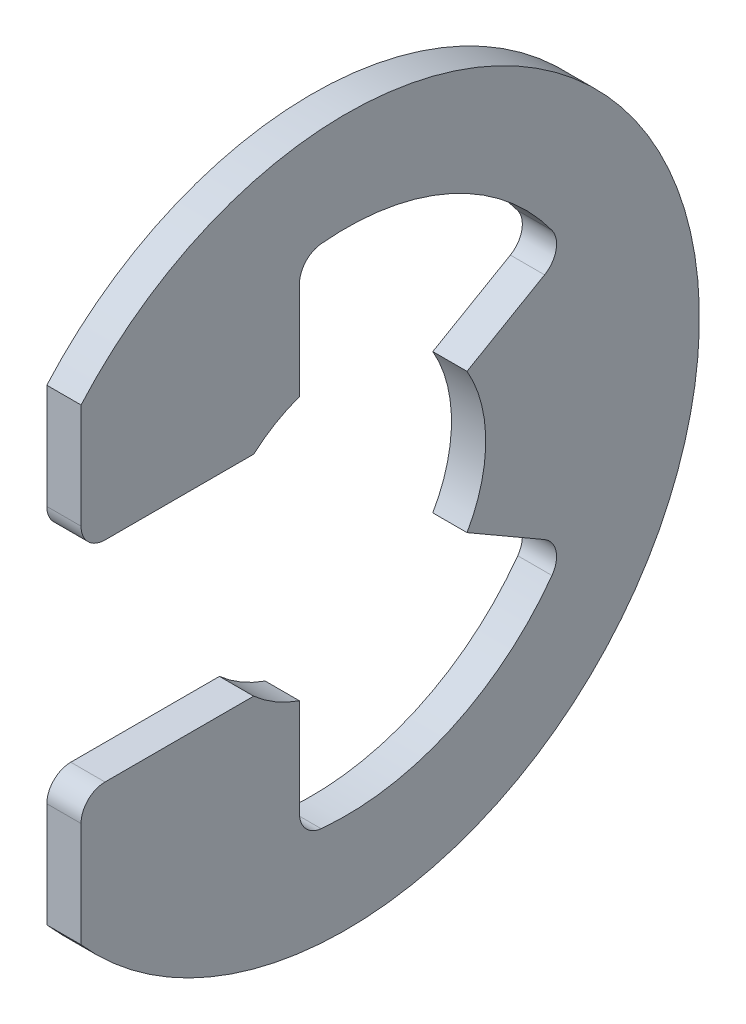
ISO-10303-21;
HEADER;
FILE_DESCRIPTION(('STEP AP214'),'2;1');
FILE_NAME('part.step','',(''),(''),'','','');
FILE_SCHEMA(('AUTOMOTIVE_DESIGN { 1 0 10303 214 1 1 1 1 }'));
ENDSEC;
DATA;
#1=APPLICATION_CONTEXT('core data for automotive mechanical design processes');
#2=APPLICATION_PROTOCOL_DEFINITION('international standard','automotive_design',2000,#1);
#3=PRODUCT_CONTEXT('',#1,'mechanical');
#4=PRODUCT('Part','Part','',(#3));
#5=PRODUCT_RELATED_PRODUCT_CATEGORY('part','',(#4));
#6=PRODUCT_DEFINITION_FORMATION('','',#4);
#7=PRODUCT_DEFINITION_CONTEXT('part definition',#1,'design');
#8=PRODUCT_DEFINITION('design','',#6,#7);
#9=PRODUCT_DEFINITION_SHAPE('','',#8);
#10=(LENGTH_UNIT() NAMED_UNIT(*) SI_UNIT(.MILLI.,.METRE.));
#11=(NAMED_UNIT(*) PLANE_ANGLE_UNIT() SI_UNIT($,.RADIAN.));
#12=(NAMED_UNIT(*) SI_UNIT($,.STERADIAN.) SOLID_ANGLE_UNIT());
#13=UNCERTAINTY_MEASURE_WITH_UNIT(LENGTH_MEASURE(1.E-05),#10,'distance_accuracy_value','');
#14=(GEOMETRIC_REPRESENTATION_CONTEXT(3) GLOBAL_UNCERTAINTY_ASSIGNED_CONTEXT((#13)) GLOBAL_UNIT_ASSIGNED_CONTEXT((#10,
#11,#12)) REPRESENTATION_CONTEXT('',''));
#15=CARTESIAN_POINT('',(0.,0.,0.));
#16=DIRECTION('',(0.,0.,1.));
#17=DIRECTION('',(1.,0.,0.));
#18=AXIS2_PLACEMENT_3D('',#15,#16,#17);
#19=CARTESIAN_POINT('',(0.3175,0.,0.));
#20=DIRECTION('',(-1.,0.,0.));
#21=DIRECTION('',(0.,0.,1.));
#22=AXIS2_PLACEMENT_3D('',#19,#20,#21);
#23=CYLINDRICAL_SURFACE('',#22,6.5532);
#24=CARTESIAN_POINT('',(-0.3175,0.,0.));
#25=DIRECTION('',(1.,0.,0.));
#26=DIRECTION('',(0.,0.,-1.));
#27=AXIS2_PLACEMENT_3D('',#24,#25,#26);
#28=CIRCLE('',#27,6.5532);
#29=CARTESIAN_POINT('',(-0.3175,-4.33453437291712,4.9149));
#30=VERTEX_POINT('',#29);
#31=CARTESIAN_POINT('',(-0.3175,4.33453437291712,4.9149));
#32=VERTEX_POINT('',#31);
#33=EDGE_CURVE('E194',#30,#32,#28,.T.);
#34=ORIENTED_EDGE('',*,*,#33,.T.);
#35=DIRECTION('',(-1.,0.,0.));
#36=VECTOR('',#35,1.);
#37=CARTESIAN_POINT('',(0.3175,4.33453437291712,4.9149));
#38=LINE('',#37,#36);
#39=CARTESIAN_POINT('',(0.3175,4.33453437291712,4.9149));
#40=VERTEX_POINT('',#39);
#41=EDGE_CURVE('E175',#40,#32,#38,.T.);
#42=ORIENTED_EDGE('',*,*,#41,.F.);
#43=CARTESIAN_POINT('',(0.3175,0.,0.));
#44=DIRECTION('',(1.,0.,0.));
#45=DIRECTION('',(0.,0.,-1.));
#46=AXIS2_PLACEMENT_3D('',#43,#44,#45);
#47=CIRCLE('',#46,6.5532);
#48=CARTESIAN_POINT('',(0.3175,-4.33453437291712,4.9149));
#49=VERTEX_POINT('',#48);
#50=EDGE_CURVE('E181',#49,#40,#47,.T.);
#51=ORIENTED_EDGE('',*,*,#50,.F.);
#52=DIRECTION('',(-1.,0.,0.));
#53=VECTOR('',#52,1.);
#54=CARTESIAN_POINT('',(0.3175,-4.33453437291712,4.9149));
#55=LINE('',#54,#53);
#56=EDGE_CURVE('E296',#49,#30,#55,.T.);
#57=ORIENTED_EDGE('',*,*,#56,.T.);
#58=EDGE_LOOP('',(#34,#42,#51,#57));
#59=FACE_BOUND('',#58,.T.);
#60=ADVANCED_FACE('F32',(#59),#23,.T.);
#61=CARTESIAN_POINT('',(0.3175,4.33453437291712,4.9149));
#62=DIRECTION('',(0.,0.,-1.));
#63=DIRECTION('',(-1.,0.,0.));
#64=AXIS2_PLACEMENT_3D('',#61,#62,#63);
#65=PLANE('',#64);
#66=DIRECTION('',(0.,-1.,0.));
#67=VECTOR('',#66,1.);
#68=CARTESIAN_POINT('',(-0.3175,4.33453437291712,4.9149));
#69=LINE('',#68,#67);
#70=CARTESIAN_POINT('',(-0.3175,2.3876,4.9149));
#71=VERTEX_POINT('',#70);
#72=EDGE_CURVE('E298',#32,#71,#69,.T.);
#73=ORIENTED_EDGE('',*,*,#72,.T.);
#74=DIRECTION('',(-1.,0.,0.));
#75=VECTOR('',#74,1.);
#76=CARTESIAN_POINT('',(0.3175,2.3876,4.9149));
#77=LINE('',#76,#75);
#78=CARTESIAN_POINT('',(0.3175,2.3876,4.9149));
#79=VERTEX_POINT('',#78);
#80=EDGE_CURVE('E178',#71,#79,#77,.F.);
#81=ORIENTED_EDGE('',*,*,#80,.T.);
#82=DIRECTION('',(0.,-1.,0.));
#83=VECTOR('',#82,1.);
#84=CARTESIAN_POINT('',(0.3175,4.33453437291712,4.9149));
#85=LINE('',#84,#83);
#86=EDGE_CURVE('E170',#40,#79,#85,.T.);
#87=ORIENTED_EDGE('',*,*,#86,.F.);
#88=ORIENTED_EDGE('',*,*,#41,.T.);
#89=EDGE_LOOP('',(#73,#81,#87,#88));
#90=FACE_BOUND('',#89,.T.);
#91=ADVANCED_FACE('F173',(#90),#65,.F.);
#92=CARTESIAN_POINT('',(0.3175,1.9431,1.71365312417654));
#93=DIRECTION('',(0.,1.,0.));
#94=DIRECTION('',(0.,0.,1.));
#95=AXIS2_PLACEMENT_3D('',#92,#93,#94);
#96=PLANE('',#95);
#97=DIRECTION('',(0.,0.,-1.));
#98=VECTOR('',#97,1.);
#99=CARTESIAN_POINT('',(0.3175,1.9431,1.71365312417654));
#100=LINE('',#99,#98);
#101=CARTESIAN_POINT('',(0.3175,1.9431,4.4704));
#102=VERTEX_POINT('',#101);
#103=CARTESIAN_POINT('',(0.3175,1.9431,1.71365312417654));
#104=VERTEX_POINT('',#103);
#105=EDGE_CURVE('E180',#102,#104,#100,.T.);
#106=ORIENTED_EDGE('',*,*,#105,.F.);
#107=DIRECTION('',(-1.,0.,0.));
#108=VECTOR('',#107,1.);
#109=CARTESIAN_POINT('',(0.3175,1.9431,4.4704));
#110=LINE('',#109,#108);
#111=CARTESIAN_POINT('',(-0.3175,1.9431,4.4704));
#112=VERTEX_POINT('',#111);
#113=EDGE_CURVE('E222',#102,#112,#110,.T.);
#114=ORIENTED_EDGE('',*,*,#113,.T.);
#115=DIRECTION('',(0.,0.,-1.));
#116=VECTOR('',#115,1.);
#117=CARTESIAN_POINT('',(-0.3175,1.9431,1.71365312417654));
#118=LINE('',#117,#116);
#119=CARTESIAN_POINT('',(-0.3175,1.9431,1.71365312417654));
#120=VERTEX_POINT('',#119);
#121=EDGE_CURVE('E300',#112,#120,#118,.T.);
#122=ORIENTED_EDGE('',*,*,#121,.T.);
#123=DIRECTION('',(-1.,0.,0.));
#124=VECTOR('',#123,1.);
#125=CARTESIAN_POINT('',(0.3175,1.9431,1.71365312417654));
#126=LINE('',#125,#124);
#127=EDGE_CURVE('E196',#104,#120,#126,.T.);
#128=ORIENTED_EDGE('',*,*,#127,.F.);
#129=EDGE_LOOP('',(#106,#114,#122,#128));
#130=FACE_BOUND('',#129,.T.);
#131=ADVANCED_FACE('F354',(#130),#96,.F.);
#132=CARTESIAN_POINT('',(0.3175,0.,0.));
#133=DIRECTION('',(-1.,0.,0.));
#134=DIRECTION('',(0.,0.,1.));
#135=AXIS2_PLACEMENT_3D('',#132,#133,#134);
#136=CYLINDRICAL_SURFACE('',#135,2.5908);
#137=CARTESIAN_POINT('',(-0.3175,0.,0.));
#138=DIRECTION('',(-1.,0.,0.));
#139=DIRECTION('',(0.,0.,1.));
#140=AXIS2_PLACEMENT_3D('',#137,#138,#139);
#141=CIRCLE('',#140,2.5908);
#142=CARTESIAN_POINT('',(-0.3175,2.44262966493081,0.863599999999999));
#143=VERTEX_POINT('',#142);
#144=EDGE_CURVE('E302',#120,#143,#141,.T.);
#145=ORIENTED_EDGE('',*,*,#144,.T.);
#146=DIRECTION('',(-1.,0.,0.));
#147=VECTOR('',#146,1.);
#148=CARTESIAN_POINT('',(0.3175,2.44262966493081,0.863599999999999));
#149=LINE('',#148,#147);
#150=CARTESIAN_POINT('',(0.3175,2.44262966493081,0.863599999999999));
#151=VERTEX_POINT('',#150);
#152=EDGE_CURVE('E202',#151,#143,#149,.T.);
#153=ORIENTED_EDGE('',*,*,#152,.F.);
#154=CARTESIAN_POINT('',(0.3175,0.,0.));
#155=DIRECTION('',(-1.,0.,0.));
#156=DIRECTION('',(0.,0.,1.));
#157=AXIS2_PLACEMENT_3D('',#154,#155,#156);
#158=CIRCLE('',#157,2.5908);
#159=EDGE_CURVE('E347',#104,#151,#158,.T.);
#160=ORIENTED_EDGE('',*,*,#159,.F.);
#161=ORIENTED_EDGE('',*,*,#127,.T.);
#162=EDGE_LOOP('',(#145,#153,#160,#161));
#163=FACE_BOUND('',#162,.T.);
#164=ADVANCED_FACE('F355',(#163),#136,.F.);
#165=CARTESIAN_POINT('',(0.3175,4.63979773786796,0.863599999999999));
#166=DIRECTION('',(0.,0.,1.));
#167=DIRECTION('',(0.,-1.,0.));
#168=AXIS2_PLACEMENT_3D('',#165,#166,#167);
#169=PLANE('',#168);
#170=DIRECTION('',(0.,1.,0.));
#171=VECTOR('',#170,1.);
#172=CARTESIAN_POINT('',(-0.3175,4.63979773786796,0.863599999999999));
#173=LINE('',#172,#171);
#174=CARTESIAN_POINT('',(-0.3175,4.25439094196036,0.863599999999999));
#175=VERTEX_POINT('',#174);
#176=EDGE_CURVE('E265',#143,#175,#173,.T.);
#177=ORIENTED_EDGE('',*,*,#176,.T.);
#178=DIRECTION('',(1.,0.,0.));
#179=VECTOR('',#178,1.);
#180=CARTESIAN_POINT('',(0.3175,4.25439094196036,0.863599999999999));
#181=LINE('',#180,#179);
#182=CARTESIAN_POINT('',(0.3175,4.25439094196036,0.863599999999999));
#183=VERTEX_POINT('',#182);
#184=EDGE_CURVE('E231',#175,#183,#181,.T.);
#185=ORIENTED_EDGE('',*,*,#184,.T.);
#186=DIRECTION('',(0.,1.,0.));
#187=VECTOR('',#186,1.);
#188=CARTESIAN_POINT('',(0.3175,4.63979773786796,0.863599999999999));
#189=LINE('',#188,#187);
#190=EDGE_CURVE('E281',#151,#183,#189,.T.);
#191=ORIENTED_EDGE('',*,*,#190,.F.);
#192=ORIENTED_EDGE('',*,*,#152,.T.);
#193=EDGE_LOOP('',(#177,#185,#191,#192));
#194=FACE_BOUND('',#193,.T.);
#195=ADVANCED_FACE('F337',(#194),#169,.F.);
#196=CARTESIAN_POINT('',(0.3175,0.,0.));
#197=DIRECTION('',(-1.,0.,0.));
#198=DIRECTION('',(0.,0.,1.));
#199=AXIS2_PLACEMENT_3D('',#196,#197,#198);
#200=CYLINDRICAL_SURFACE('',#199,4.71948387096774);
#201=CARTESIAN_POINT('',(0.3175,0.,0.));
#202=DIRECTION('',(-1.,0.,0.));
#203=DIRECTION('',(0.,0.,-1.));
#204=AXIS2_PLACEMENT_3D('',#201,#202,#203);
#205=CIRCLE('',#204,4.71948387096774);
#206=CARTESIAN_POINT('',(0.3175,4.69674975097109,0.462676760900813));
#207=VERTEX_POINT('',#206);
#208=CARTESIAN_POINT('',(0.3175,2.77192549140521,-3.81968023248316));
#209=VERTEX_POINT('',#208);
#210=EDGE_CURVE('E271',#207,#209,#205,.T.);
#211=ORIENTED_EDGE('',*,*,#210,.F.);
#212=DIRECTION('',(-1.,0.,0.));
#213=VECTOR('',#212,1.);
#214=CARTESIAN_POINT('',(0.3175,4.69674975097109,0.462676760900814));
#215=LINE('',#214,#213);
#216=CARTESIAN_POINT('',(-0.3175,4.69674975097109,0.462676760900813));
#217=VERTEX_POINT('',#216);
#218=EDGE_CURVE('E228',#207,#217,#215,.T.);
#219=ORIENTED_EDGE('',*,*,#218,.T.);
#220=CARTESIAN_POINT('',(-0.3175,0.,0.));
#221=DIRECTION('',(-1.,0.,0.));
#222=DIRECTION('',(0.,0.,-1.));
#223=AXIS2_PLACEMENT_3D('',#220,#221,#222);
#224=CIRCLE('',#223,4.71948387096774);
#225=CARTESIAN_POINT('',(-0.3175,2.77192549140521,-3.81968023248316));
#226=VERTEX_POINT('',#225);
#227=EDGE_CURVE('E254',#217,#226,#224,.T.);
#228=ORIENTED_EDGE('',*,*,#227,.T.);
#229=DIRECTION('',(-1.,0.,0.));
#230=VECTOR('',#229,1.);
#231=CARTESIAN_POINT('',(0.3175,2.77192549140521,-3.81968023248317));
#232=LINE('',#231,#230);
#233=EDGE_CURVE('E226',#226,#209,#232,.F.);
#234=ORIENTED_EDGE('',*,*,#233,.T.);
#235=EDGE_LOOP('',(#211,#219,#228,#234));
#236=FACE_BOUND('',#235,.T.);
#237=ADVANCED_FACE('F262',(#236),#200,.F.);
#238=CARTESIAN_POINT('',(0.3175,1.2954,-2.24369861612472));
#239=DIRECTION('',(0.,-0.866025403784438,-0.500000000000001));
#240=DIRECTION('',(0.,0.500000000000001,-0.866025403784438));
#241=AXIS2_PLACEMENT_3D('',#238,#239,#240);
#242=PLANE('',#241);
#243=DIRECTION('',(0.,-0.500000000000001,0.866025403784438));
#244=VECTOR('',#243,1.);
#245=CARTESIAN_POINT('',(0.3175,1.2954,-2.24369861612472));
#246=LINE('',#245,#244);
#247=CARTESIAN_POINT('',(0.3175,2.12590609194259,-3.68217736336474));
#248=VERTEX_POINT('',#247);
#249=CARTESIAN_POINT('',(0.3175,1.2954,-2.24369861612472));
#250=VERTEX_POINT('',#249);
#251=EDGE_CURVE('E269',#248,#250,#246,.T.);
#252=ORIENTED_EDGE('',*,*,#251,.F.);
#253=DIRECTION('',(1.,0.,0.));
#254=VECTOR('',#253,1.);
#255=CARTESIAN_POINT('',(-0.3175,2.12590609194259,-3.68217736336474));
#256=LINE('',#255,#254);
#257=CARTESIAN_POINT('',(-0.3175,2.12590609194259,-3.68217736336474));
#258=VERTEX_POINT('',#257);
#259=EDGE_CURVE('E235',#248,#258,#256,.F.);
#260=ORIENTED_EDGE('',*,*,#259,.T.);
#261=DIRECTION('',(0.,-0.500000000000001,0.866025403784438));
#262=VECTOR('',#261,1.);
#263=CARTESIAN_POINT('',(-0.3175,1.2954,-2.24369861612472));
#264=LINE('',#263,#262);
#265=CARTESIAN_POINT('',(-0.3175,1.2954,-2.24369861612472));
#266=VERTEX_POINT('',#265);
#267=EDGE_CURVE('E256',#258,#266,#264,.T.);
#268=ORIENTED_EDGE('',*,*,#267,.T.);
#269=DIRECTION('',(-1.,0.,0.));
#270=VECTOR('',#269,1.);
#271=CARTESIAN_POINT('',(0.3175,1.2954,-2.24369861612472));
#272=LINE('',#271,#270);
#273=EDGE_CURVE('E275',#250,#266,#272,.T.);
#274=ORIENTED_EDGE('',*,*,#273,.F.);
#275=EDGE_LOOP('',(#252,#260,#268,#274));
#276=FACE_BOUND('',#275,.T.);
#277=ADVANCED_FACE('F273',(#276),#242,.F.);
#278=CARTESIAN_POINT('',(0.3175,0.,0.));
#279=DIRECTION('',(-1.,0.,0.));
#280=DIRECTION('',(0.,0.,1.));
#281=AXIS2_PLACEMENT_3D('',#278,#279,#280);
#282=CYLINDRICAL_SURFACE('',#281,2.5908);
#283=CARTESIAN_POINT('',(-0.3175,0.,0.));
#284=DIRECTION('',(-1.,0.,0.));
#285=DIRECTION('',(0.,0.,1.));
#286=AXIS2_PLACEMENT_3D('',#283,#284,#285);
#287=CIRCLE('',#286,2.5908);
#288=CARTESIAN_POINT('',(-0.3175,-1.2954,-2.24369861612472));
#289=VERTEX_POINT('',#288);
#290=EDGE_CURVE('E307',#266,#289,#287,.T.);
#291=ORIENTED_EDGE('',*,*,#290,.T.);
#292=DIRECTION('',(-1.,0.,0.));
#293=VECTOR('',#292,1.);
#294=CARTESIAN_POINT('',(0.3175,-1.2954,-2.24369861612472));
#295=LINE('',#294,#293);
#296=CARTESIAN_POINT('',(0.3175,-1.2954,-2.24369861612472));
#297=VERTEX_POINT('',#296);
#298=EDGE_CURVE('E329',#297,#289,#295,.T.);
#299=ORIENTED_EDGE('',*,*,#298,.F.);
#300=CARTESIAN_POINT('',(0.3175,0.,0.));
#301=DIRECTION('',(-1.,0.,0.));
#302=DIRECTION('',(0.,0.,1.));
#303=AXIS2_PLACEMENT_3D('',#300,#301,#302);
#304=CIRCLE('',#303,2.5908);
#305=EDGE_CURVE('E277',#250,#297,#304,.T.);
#306=ORIENTED_EDGE('',*,*,#305,.F.);
#307=ORIENTED_EDGE('',*,*,#273,.T.);
#308=EDGE_LOOP('',(#291,#299,#306,#307));
#309=FACE_BOUND('',#308,.T.);
#310=ADVANCED_FACE('F435',(#309),#282,.F.);
#311=CARTESIAN_POINT('',(0.3175,-1.2954,-2.24369861612472));
#312=DIRECTION('',(0.,0.866025403784438,-0.500000000000001));
#313=DIRECTION('',(0.,0.500000000000001,0.866025403784438));
#314=AXIS2_PLACEMENT_3D('',#311,#312,#313);
#315=PLANE('',#314);
#316=DIRECTION('',(0.,-0.500000000000001,-0.866025403784438));
#317=VECTOR('',#316,1.);
#318=CARTESIAN_POINT('',(-0.3175,-1.2954,-2.24369861612472));
#319=LINE('',#318,#317);
#320=CARTESIAN_POINT('',(-0.3175,-2.12590609194259,-3.68217736336474));
#321=VERTEX_POINT('',#320);
#322=EDGE_CURVE('E309',#289,#321,#319,.T.);
#323=ORIENTED_EDGE('',*,*,#322,.T.);
#324=DIRECTION('',(1.,0.,0.));
#325=VECTOR('',#324,1.);
#326=CARTESIAN_POINT('',(0.3175,-2.12590609194259,-3.68217736336474));
#327=LINE('',#326,#325);
#328=CARTESIAN_POINT('',(0.3175,-2.12590609194259,-3.68217736336474));
#329=VERTEX_POINT('',#328);
#330=EDGE_CURVE('E233',#321,#329,#327,.T.);
#331=ORIENTED_EDGE('',*,*,#330,.T.);
#332=DIRECTION('',(0.,-0.500000000000001,-0.866025403784438));
#333=VECTOR('',#332,1.);
#334=CARTESIAN_POINT('',(0.3175,-1.2954,-2.24369861612472));
#335=LINE('',#334,#333);
#336=EDGE_CURVE('E279',#297,#329,#335,.T.);
#337=ORIENTED_EDGE('',*,*,#336,.F.);
#338=ORIENTED_EDGE('',*,*,#298,.T.);
#339=EDGE_LOOP('',(#323,#331,#337,#338));
#340=FACE_BOUND('',#339,.T.);
#341=ADVANCED_FACE('F432',(#340),#315,.F.);
#342=CARTESIAN_POINT('',(0.3175,0.,0.));
#343=DIRECTION('',(-1.,0.,0.));
#344=DIRECTION('',(0.,0.,1.));
#345=AXIS2_PLACEMENT_3D('',#342,#343,#344);
#346=CYLINDRICAL_SURFACE('',#345,4.71948387096774);
#347=CARTESIAN_POINT('',(-0.3175,0.,0.));
#348=DIRECTION('',(-1.,0.,0.));
#349=DIRECTION('',(0.,0.,-1.));
#350=AXIS2_PLACEMENT_3D('',#347,#348,#349);
#351=CIRCLE('',#350,4.71948387096774);
#352=CARTESIAN_POINT('',(-0.3175,-2.77192549140521,-3.81968023248317));
#353=VERTEX_POINT('',#352);
#354=CARTESIAN_POINT('',(-0.3175,-4.69674975097109,0.462676760900812));
#355=VERTEX_POINT('',#354);
#356=EDGE_CURVE('E312',#353,#355,#351,.T.);
#357=ORIENTED_EDGE('',*,*,#356,.T.);
#358=DIRECTION('',(-1.,0.,0.));
#359=VECTOR('',#358,1.);
#360=CARTESIAN_POINT('',(0.3175,-4.69674975097109,0.462676760900812));
#361=LINE('',#360,#359);
#362=CARTESIAN_POINT('',(0.3175,-4.69674975097109,0.462676760900812));
#363=VERTEX_POINT('',#362);
#364=EDGE_CURVE('E55',#355,#363,#361,.F.);
#365=ORIENTED_EDGE('',*,*,#364,.T.);
#366=CARTESIAN_POINT('',(0.3175,0.,0.));
#367=DIRECTION('',(-1.,0.,0.));
#368=DIRECTION('',(0.,0.,-1.));
#369=AXIS2_PLACEMENT_3D('',#366,#367,#368);
#370=CIRCLE('',#369,4.71948387096774);
#371=CARTESIAN_POINT('',(0.3175,-2.77192549140521,-3.81968023248317));
#372=VERTEX_POINT('',#371);
#373=EDGE_CURVE('E287',#372,#363,#370,.T.);
#374=ORIENTED_EDGE('',*,*,#373,.F.);
#375=DIRECTION('',(-1.,0.,0.));
#376=VECTOR('',#375,1.);
#377=CARTESIAN_POINT('',(0.3175,-2.77192549140521,-3.81968023248317));
#378=LINE('',#377,#376);
#379=EDGE_CURVE('E218',#372,#353,#378,.T.);
#380=ORIENTED_EDGE('',*,*,#379,.T.);
#381=EDGE_LOOP('',(#357,#365,#374,#380));
#382=FACE_BOUND('',#381,.T.);
#383=ADVANCED_FACE('F394',(#382),#346,.F.);
#384=CARTESIAN_POINT('',(0.3175,-2.44262966493081,0.863599999999998));
#385=DIRECTION('',(0.,0.,1.));
#386=DIRECTION('',(0.,-1.,0.));
#387=AXIS2_PLACEMENT_3D('',#384,#385,#386);
#388=PLANE('',#387);
#389=DIRECTION('',(0.,1.,0.));
#390=VECTOR('',#389,1.);
#391=CARTESIAN_POINT('',(0.3175,-2.44262966493081,0.863599999999998));
#392=LINE('',#391,#390);
#393=CARTESIAN_POINT('',(0.3175,-4.25439094196036,0.863599999999998));
#394=VERTEX_POINT('',#393);
#395=CARTESIAN_POINT('',(0.3175,-2.44262966493081,0.8636));
#396=VERTEX_POINT('',#395);
#397=EDGE_CURVE('E289',#394,#396,#392,.T.);
#398=ORIENTED_EDGE('',*,*,#397,.F.);
#399=DIRECTION('',(1.,0.,0.));
#400=VECTOR('',#399,1.);
#401=CARTESIAN_POINT('',(-0.3175,-4.25439094196036,0.863599999999998));
#402=LINE('',#401,#400);
#403=CARTESIAN_POINT('',(-0.3175,-4.25439094196036,0.863599999999998));
#404=VERTEX_POINT('',#403);
#405=EDGE_CURVE('E215',#394,#404,#402,.F.);
#406=ORIENTED_EDGE('',*,*,#405,.T.);
#407=DIRECTION('',(0.,1.,0.));
#408=VECTOR('',#407,1.);
#409=CARTESIAN_POINT('',(-0.3175,-2.44262966493081,0.863599999999998));
#410=LINE('',#409,#408);
#411=CARTESIAN_POINT('',(-0.3175,-2.44262966493081,0.8636));
#412=VERTEX_POINT('',#411);
#413=EDGE_CURVE('E314',#404,#412,#410,.T.);
#414=ORIENTED_EDGE('',*,*,#413,.T.);
#415=DIRECTION('',(-1.,0.,0.));
#416=VECTOR('',#415,1.);
#417=CARTESIAN_POINT('',(0.3175,-2.44262966493081,0.8636));
#418=LINE('',#417,#416);
#419=EDGE_CURVE('E326',#396,#412,#418,.T.);
#420=ORIENTED_EDGE('',*,*,#419,.F.);
#421=EDGE_LOOP('',(#398,#406,#414,#420));
#422=FACE_BOUND('',#421,.T.);
#423=ADVANCED_FACE('F401',(#422),#388,.F.);
#424=CARTESIAN_POINT('',(0.3175,0.,0.));
#425=DIRECTION('',(-1.,0.,0.));
#426=DIRECTION('',(0.,0.,1.));
#427=AXIS2_PLACEMENT_3D('',#424,#425,#426);
#428=CYLINDRICAL_SURFACE('',#427,2.5908);
#429=CARTESIAN_POINT('',(-0.3175,0.,0.));
#430=DIRECTION('',(-1.,0.,0.));
#431=DIRECTION('',(0.,0.,-1.));
#432=AXIS2_PLACEMENT_3D('',#429,#430,#431);
#433=CIRCLE('',#432,2.5908);
#434=CARTESIAN_POINT('',(-0.3175,-1.9431,1.71365312417653));
#435=VERTEX_POINT('',#434);
#436=EDGE_CURVE('E316',#412,#435,#433,.T.);
#437=ORIENTED_EDGE('',*,*,#436,.T.);
#438=DIRECTION('',(-1.,0.,0.));
#439=VECTOR('',#438,1.);
#440=CARTESIAN_POINT('',(0.3175,-1.9431,1.71365312417653));
#441=LINE('',#440,#439);
#442=CARTESIAN_POINT('',(0.3175,-1.9431,1.71365312417653));
#443=VERTEX_POINT('',#442);
#444=EDGE_CURVE('E323',#443,#435,#441,.T.);
#445=ORIENTED_EDGE('',*,*,#444,.F.);
#446=CARTESIAN_POINT('',(0.3175,0.,0.));
#447=DIRECTION('',(-1.,0.,0.));
#448=DIRECTION('',(0.,0.,-1.));
#449=AXIS2_PLACEMENT_3D('',#446,#447,#448);
#450=CIRCLE('',#449,2.5908);
#451=EDGE_CURVE('E291',#396,#443,#450,.T.);
#452=ORIENTED_EDGE('',*,*,#451,.F.);
#453=ORIENTED_EDGE('',*,*,#419,.T.);
#454=EDGE_LOOP('',(#437,#445,#452,#453));
#455=FACE_BOUND('',#454,.T.);
#456=ADVANCED_FACE('F408',(#455),#428,.F.);
#457=CARTESIAN_POINT('',(0.3175,-1.9431,4.9149));
#458=DIRECTION('',(0.,-1.,0.));
#459=DIRECTION('',(0.,0.,-1.));
#460=AXIS2_PLACEMENT_3D('',#457,#458,#459);
#461=PLANE('',#460);
#462=DIRECTION('',(0.,0.,1.));
#463=VECTOR('',#462,1.);
#464=CARTESIAN_POINT('',(-0.3175,-1.9431,4.9149));
#465=LINE('',#464,#463);
#466=CARTESIAN_POINT('',(-0.3175,-1.9431,4.4704));
#467=VERTEX_POINT('',#466);
#468=EDGE_CURVE('E318',#435,#467,#465,.T.);
#469=ORIENTED_EDGE('',*,*,#468,.T.);
#470=DIRECTION('',(-1.,0.,0.));
#471=VECTOR('',#470,1.);
#472=CARTESIAN_POINT('',(0.3175,-1.9431,4.4704));
#473=LINE('',#472,#471);
#474=CARTESIAN_POINT('',(0.3175,-1.9431,4.4704));
#475=VERTEX_POINT('',#474);
#476=EDGE_CURVE('E209',#467,#475,#473,.F.);
#477=ORIENTED_EDGE('',*,*,#476,.T.);
#478=DIRECTION('',(0.,0.,1.));
#479=VECTOR('',#478,1.);
#480=CARTESIAN_POINT('',(0.3175,-1.9431,4.9149));
#481=LINE('',#480,#479);
#482=EDGE_CURVE('E293',#443,#475,#481,.T.);
#483=ORIENTED_EDGE('',*,*,#482,.F.);
#484=ORIENTED_EDGE('',*,*,#444,.T.);
#485=EDGE_LOOP('',(#469,#477,#483,#484));
#486=FACE_BOUND('',#485,.T.);
#487=ADVANCED_FACE('F411',(#486),#461,.F.);
#488=CARTESIAN_POINT('',(0.3175,-4.33453437291712,4.9149));
#489=DIRECTION('',(0.,0.,-1.));
#490=DIRECTION('',(-1.,0.,0.));
#491=AXIS2_PLACEMENT_3D('',#488,#489,#490);
#492=PLANE('',#491);
#493=DIRECTION('',(0.,-1.,0.));
#494=VECTOR('',#493,1.);
#495=CARTESIAN_POINT('',(0.3175,-4.33453437291712,4.9149));
#496=LINE('',#495,#494);
#497=CARTESIAN_POINT('',(0.3175,-2.3876,4.9149));
#498=VERTEX_POINT('',#497);
#499=EDGE_CURVE('E187',#498,#49,#496,.T.);
#500=ORIENTED_EDGE('',*,*,#499,.F.);
#501=DIRECTION('',(-1.,0.,0.));
#502=VECTOR('',#501,1.);
#503=CARTESIAN_POINT('',(0.3175,-2.3876,4.9149));
#504=LINE('',#503,#502);
#505=CARTESIAN_POINT('',(-0.3175,-2.3876,4.9149));
#506=VERTEX_POINT('',#505);
#507=EDGE_CURVE('E195',#498,#506,#504,.T.);
#508=ORIENTED_EDGE('',*,*,#507,.T.);
#509=DIRECTION('',(0.,-1.,0.));
#510=VECTOR('',#509,1.);
#511=CARTESIAN_POINT('',(-0.3175,-4.33453437291712,4.9149));
#512=LINE('',#511,#510);
#513=EDGE_CURVE('E191',#506,#30,#512,.T.);
#514=ORIENTED_EDGE('',*,*,#513,.T.);
#515=ORIENTED_EDGE('',*,*,#56,.F.);
#516=EDGE_LOOP('',(#500,#508,#514,#515));
#517=FACE_BOUND('',#516,.T.);
#518=ADVANCED_FACE('F415',(#517),#492,.F.);
#519=CARTESIAN_POINT('',(0.3175,0.,0.));
#520=DIRECTION('',(1.,0.,0.));
#521=DIRECTION('',(0.,0.,-1.));
#522=AXIS2_PLACEMENT_3D('',#519,#520,#521);
#523=PLANE('',#522);
#524=ORIENTED_EDGE('',*,*,#482,.T.);
#525=CARTESIAN_POINT('',(0.3175,-2.3876,4.4704));
#526=DIRECTION('',(1.,0.,0.));
#527=DIRECTION('',(0.,0.,-1.));
#528=AXIS2_PLACEMENT_3D('',#525,#526,#527);
#529=CIRCLE('',#528,0.4445);
#530=EDGE_CURVE('E213',#475,#498,#529,.T.);
#531=ORIENTED_EDGE('',*,*,#530,.T.);
#532=ORIENTED_EDGE('',*,*,#499,.T.);
#533=ORIENTED_EDGE('',*,*,#50,.T.);
#534=ORIENTED_EDGE('',*,*,#86,.T.);
#535=CARTESIAN_POINT('',(0.3175,2.3876,4.4704));
#536=DIRECTION('',(1.,0.,0.));
#537=DIRECTION('',(0.,0.,-1.));
#538=AXIS2_PLACEMENT_3D('',#535,#536,#537);
#539=CIRCLE('',#538,0.4445);
#540=EDGE_CURVE('E211',#79,#102,#539,.T.);
#541=ORIENTED_EDGE('',*,*,#540,.T.);
#542=ORIENTED_EDGE('',*,*,#105,.T.);
#543=ORIENTED_EDGE('',*,*,#159,.T.);
#544=ORIENTED_EDGE('',*,*,#190,.T.);
#545=CARTESIAN_POINT('',(0.3175,4.25439094196036,0.419099999999999));
#546=DIRECTION('',(1.,0.,0.));
#547=DIRECTION('',(0.,0.,-1.));
#548=AXIS2_PLACEMENT_3D('',#545,#546,#547);
#549=CIRCLE('',#548,0.4445);
#550=EDGE_CURVE('E243',#183,#207,#549,.F.);
#551=ORIENTED_EDGE('',*,*,#550,.T.);
#552=ORIENTED_EDGE('',*,*,#210,.T.);
#553=CARTESIAN_POINT('',(0.3175,2.51085438392477,-3.45992736336474));
#554=DIRECTION('',(1.,0.,0.));
#555=DIRECTION('',(0.,0.,-1.));
#556=AXIS2_PLACEMENT_3D('',#553,#554,#555);
#557=CIRCLE('',#556,0.4445);
#558=EDGE_CURVE('E11',#209,#248,#557,.F.);
#559=ORIENTED_EDGE('',*,*,#558,.T.);
#560=ORIENTED_EDGE('',*,*,#251,.T.);
#561=ORIENTED_EDGE('',*,*,#305,.T.);
#562=ORIENTED_EDGE('',*,*,#336,.T.);
#563=CARTESIAN_POINT('',(0.3175,-2.51085438392477,-3.45992736336474));
#564=DIRECTION('',(1.,0.,0.));
#565=DIRECTION('',(0.,0.,-1.));
#566=AXIS2_PLACEMENT_3D('',#563,#564,#565);
#567=CIRCLE('',#566,0.4445);
#568=EDGE_CURVE('E247',#329,#372,#567,.F.);
#569=ORIENTED_EDGE('',*,*,#568,.T.);
#570=ORIENTED_EDGE('',*,*,#373,.T.);
#571=CARTESIAN_POINT('',(0.3175,-4.25439094196036,0.419099999999998));
#572=DIRECTION('',(1.,0.,0.));
#573=DIRECTION('',(0.,0.,-1.));
#574=AXIS2_PLACEMENT_3D('',#571,#572,#573);
#575=CIRCLE('',#574,0.4445);
#576=EDGE_CURVE('E47',#363,#394,#575,.F.);
#577=ORIENTED_EDGE('',*,*,#576,.T.);
#578=ORIENTED_EDGE('',*,*,#397,.T.);
#579=ORIENTED_EDGE('',*,*,#451,.T.);
#580=EDGE_LOOP('',(#524,#531,#532,#533,#534,#541,#542,#543,#544,#551,#552,#559,#560,#561,#562,
#569,#570,#577,#578,#579));
#581=FACE_BOUND('',#580,.T.);
#582=ADVANCED_FACE('F185',(#581),#523,.T.);
#583=CARTESIAN_POINT('',(-0.3175,0.,0.));
#584=DIRECTION('',(1.,0.,0.));
#585=DIRECTION('',(0.,0.,-1.));
#586=AXIS2_PLACEMENT_3D('',#583,#584,#585);
#587=PLANE('',#586);
#588=ORIENTED_EDGE('',*,*,#513,.F.);
#589=CARTESIAN_POINT('',(-0.3175,-2.3876,4.4704));
#590=DIRECTION('',(1.,0.,0.));
#591=DIRECTION('',(0.,0.,-1.));
#592=AXIS2_PLACEMENT_3D('',#589,#590,#591);
#593=CIRCLE('',#592,0.4445);
#594=EDGE_CURVE('E207',#506,#467,#593,.F.);
#595=ORIENTED_EDGE('',*,*,#594,.T.);
#596=ORIENTED_EDGE('',*,*,#468,.F.);
#597=ORIENTED_EDGE('',*,*,#436,.F.);
#598=ORIENTED_EDGE('',*,*,#413,.F.);
#599=CARTESIAN_POINT('',(-0.3175,-4.25439094196036,0.419099999999998));
#600=DIRECTION('',(1.,0.,0.));
#601=DIRECTION('',(0.,0.,-1.));
#602=AXIS2_PLACEMENT_3D('',#599,#600,#601);
#603=CIRCLE('',#602,0.4445);
#604=EDGE_CURVE('E238',#404,#355,#603,.T.);
#605=ORIENTED_EDGE('',*,*,#604,.T.);
#606=ORIENTED_EDGE('',*,*,#356,.F.);
#607=CARTESIAN_POINT('',(-0.3175,-2.51085438392477,-3.45992736336474));
#608=DIRECTION('',(1.,0.,0.));
#609=DIRECTION('',(0.,0.,-1.));
#610=AXIS2_PLACEMENT_3D('',#607,#608,#609);
#611=CIRCLE('',#610,0.4445);
#612=EDGE_CURVE('E245',#353,#321,#611,.T.);
#613=ORIENTED_EDGE('',*,*,#612,.T.);
#614=ORIENTED_EDGE('',*,*,#322,.F.);
#615=ORIENTED_EDGE('',*,*,#290,.F.);
#616=ORIENTED_EDGE('',*,*,#267,.F.);
#617=CARTESIAN_POINT('',(-0.3175,2.51085438392477,-3.45992736336474));
#618=DIRECTION('',(1.,0.,0.));
#619=DIRECTION('',(0.,0.,-1.));
#620=AXIS2_PLACEMENT_3D('',#617,#618,#619);
#621=CIRCLE('',#620,0.4445);
#622=EDGE_CURVE('E40',#258,#226,#621,.T.);
#623=ORIENTED_EDGE('',*,*,#622,.T.);
#624=ORIENTED_EDGE('',*,*,#227,.F.);
#625=CARTESIAN_POINT('',(-0.3175,4.25439094196036,0.419099999999999));
#626=DIRECTION('',(1.,0.,0.));
#627=DIRECTION('',(0.,0.,-1.));
#628=AXIS2_PLACEMENT_3D('',#625,#626,#627);
#629=CIRCLE('',#628,0.4445);
#630=EDGE_CURVE('E241',#217,#175,#629,.T.);
#631=ORIENTED_EDGE('',*,*,#630,.T.);
#632=ORIENTED_EDGE('',*,*,#176,.F.);
#633=ORIENTED_EDGE('',*,*,#144,.F.);
#634=ORIENTED_EDGE('',*,*,#121,.F.);
#635=CARTESIAN_POINT('',(-0.3175,2.3876,4.4704));
#636=DIRECTION('',(1.,0.,0.));
#637=DIRECTION('',(0.,0.,-1.));
#638=AXIS2_PLACEMENT_3D('',#635,#636,#637);
#639=CIRCLE('',#638,0.4445);
#640=EDGE_CURVE('E199',#112,#71,#639,.F.);
#641=ORIENTED_EDGE('',*,*,#640,.T.);
#642=ORIENTED_EDGE('',*,*,#72,.F.);
#643=ORIENTED_EDGE('',*,*,#33,.F.);
#644=EDGE_LOOP('',(#588,#595,#596,#597,#598,#605,#606,#613,#614,#615,#616,#623,#624,#631,#632,
#633,#634,#641,#642,#643));
#645=FACE_BOUND('',#644,.T.);
#646=ADVANCED_FACE('F253',(#645),#587,.F.);
#647=CARTESIAN_POINT('',(0.3175,-2.3876,4.4704));
#648=DIRECTION('',(-1.,0.,0.));
#649=DIRECTION('',(0.,0.,1.));
#650=AXIS2_PLACEMENT_3D('',#647,#648,#649);
#651=CYLINDRICAL_SURFACE('',#650,0.4445);
#652=ORIENTED_EDGE('',*,*,#530,.F.);
#653=ORIENTED_EDGE('',*,*,#476,.F.);
#654=ORIENTED_EDGE('',*,*,#594,.F.);
#655=ORIENTED_EDGE('',*,*,#507,.F.);
#656=EDGE_LOOP('',(#652,#653,#654,#655));
#657=FACE_BOUND('',#656,.T.);
#658=ADVANCED_FACE('F371',(#657),#651,.T.);
#659=CARTESIAN_POINT('',(0.3175,-4.25439094196036,0.419099999999998));
#660=DIRECTION('',(-1.,0.,0.));
#661=DIRECTION('',(0.,0.,1.));
#662=AXIS2_PLACEMENT_3D('',#659,#660,#661);
#663=CYLINDRICAL_SURFACE('',#662,0.4445);
#664=ORIENTED_EDGE('',*,*,#576,.F.);
#665=ORIENTED_EDGE('',*,*,#364,.F.);
#666=ORIENTED_EDGE('',*,*,#604,.F.);
#667=ORIENTED_EDGE('',*,*,#405,.F.);
#668=EDGE_LOOP('',(#664,#665,#666,#667));
#669=FACE_BOUND('',#668,.T.);
#670=ADVANCED_FACE('F374',(#669),#663,.F.);
#671=CARTESIAN_POINT('',(0.3175,2.3876,4.4704));
#672=DIRECTION('',(-1.,0.,0.));
#673=DIRECTION('',(0.,0.,1.));
#674=AXIS2_PLACEMENT_3D('',#671,#672,#673);
#675=CYLINDRICAL_SURFACE('',#674,0.4445);
#676=ORIENTED_EDGE('',*,*,#540,.F.);
#677=ORIENTED_EDGE('',*,*,#80,.F.);
#678=ORIENTED_EDGE('',*,*,#640,.F.);
#679=ORIENTED_EDGE('',*,*,#113,.F.);
#680=EDGE_LOOP('',(#676,#677,#678,#679));
#681=FACE_BOUND('',#680,.T.);
#682=ADVANCED_FACE('F378',(#681),#675,.T.);
#683=CARTESIAN_POINT('',(0.3175,4.25439094196036,0.419099999999999));
#684=DIRECTION('',(-1.,0.,0.));
#685=DIRECTION('',(0.,0.,1.));
#686=AXIS2_PLACEMENT_3D('',#683,#684,#685);
#687=CYLINDRICAL_SURFACE('',#686,0.4445);
#688=ORIENTED_EDGE('',*,*,#550,.F.);
#689=ORIENTED_EDGE('',*,*,#184,.F.);
#690=ORIENTED_EDGE('',*,*,#630,.F.);
#691=ORIENTED_EDGE('',*,*,#218,.F.);
#692=EDGE_LOOP('',(#688,#689,#690,#691));
#693=FACE_BOUND('',#692,.T.);
#694=ADVANCED_FACE('F346',(#693),#687,.F.);
#695=CARTESIAN_POINT('',(0.3175,-2.51085438392477,-3.45992736336474));
#696=DIRECTION('',(-1.,0.,0.));
#697=DIRECTION('',(0.,0.,1.));
#698=AXIS2_PLACEMENT_3D('',#695,#696,#697);
#699=CYLINDRICAL_SURFACE('',#698,0.4445);
#700=ORIENTED_EDGE('',*,*,#568,.F.);
#701=ORIENTED_EDGE('',*,*,#330,.F.);
#702=ORIENTED_EDGE('',*,*,#612,.F.);
#703=ORIENTED_EDGE('',*,*,#379,.F.);
#704=EDGE_LOOP('',(#700,#701,#702,#703));
#705=FACE_BOUND('',#704,.T.);
#706=ADVANCED_FACE('F384',(#705),#699,.F.);
#707=CARTESIAN_POINT('',(0.3175,2.51085438392477,-3.45992736336474));
#708=DIRECTION('',(-1.,0.,0.));
#709=DIRECTION('',(0.,0.,1.));
#710=AXIS2_PLACEMENT_3D('',#707,#708,#709);
#711=CYLINDRICAL_SURFACE('',#710,0.4445);
#712=ORIENTED_EDGE('',*,*,#558,.F.);
#713=ORIENTED_EDGE('',*,*,#233,.F.);
#714=ORIENTED_EDGE('',*,*,#622,.F.);
#715=ORIENTED_EDGE('',*,*,#259,.F.);
#716=EDGE_LOOP('',(#712,#713,#714,#715));
#717=FACE_BOUND('',#716,.T.);
#718=ADVANCED_FACE('F34',(#717),#711,.F.);
#719=CLOSED_SHELL('',(#60,#91,#131,#164,#195,#237,#277,#310,#341,#383,#423,#456,#487,#518,#582,
#646,#658,#670,#682,#694,#706,#718));
#720=MANIFOLD_SOLID_BREP('B2',#719);
#721=ADVANCED_BREP_SHAPE_REPRESENTATION('',(#18,#720),#14);
#722=SHAPE_DEFINITION_REPRESENTATION(#9,#721);
ENDSEC;
END-ISO-10303-21;
